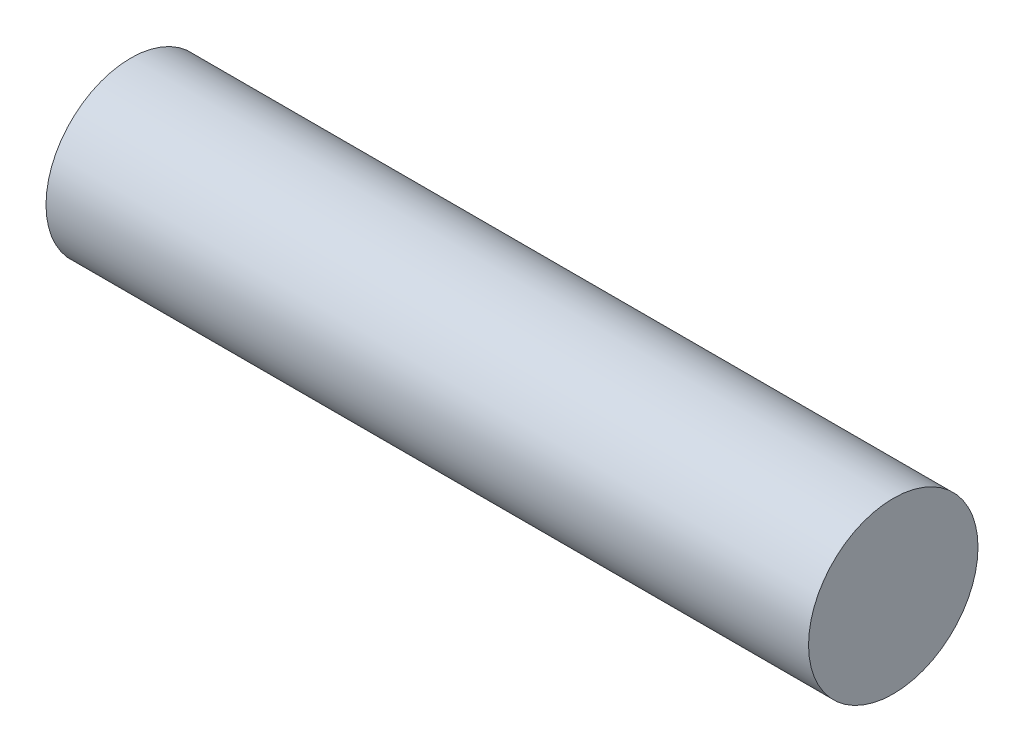
ISO-10303-21;
HEADER;
FILE_DESCRIPTION(('STEP AP214'),'2;1');
FILE_NAME('part.step','',(''),(''),'','','');
FILE_SCHEMA(('AUTOMOTIVE_DESIGN { 1 0 10303 214 1 1 1 1 }'));
ENDSEC;
DATA;
#1=APPLICATION_CONTEXT('core data for automotive mechanical design processes');
#2=APPLICATION_PROTOCOL_DEFINITION('international standard','automotive_design',2000,#1);
#3=PRODUCT_CONTEXT('',#1,'mechanical');
#4=PRODUCT('Part','Part','',(#3));
#5=PRODUCT_RELATED_PRODUCT_CATEGORY('part','',(#4));
#6=PRODUCT_DEFINITION_FORMATION('','',#4);
#7=PRODUCT_DEFINITION_CONTEXT('part definition',#1,'design');
#8=PRODUCT_DEFINITION('design','',#6,#7);
#9=PRODUCT_DEFINITION_SHAPE('','',#8);
#10=(LENGTH_UNIT() NAMED_UNIT(*) SI_UNIT(.MILLI.,.METRE.));
#11=(NAMED_UNIT(*) PLANE_ANGLE_UNIT() SI_UNIT($,.RADIAN.));
#12=(NAMED_UNIT(*) SI_UNIT($,.STERADIAN.) SOLID_ANGLE_UNIT());
#13=UNCERTAINTY_MEASURE_WITH_UNIT(LENGTH_MEASURE(1.E-05),#10,'distance_accuracy_value','');
#14=(GEOMETRIC_REPRESENTATION_CONTEXT(3) GLOBAL_UNCERTAINTY_ASSIGNED_CONTEXT((#13)) GLOBAL_UNIT_ASSIGNED_CONTEXT((#10,
#11,#12)) REPRESENTATION_CONTEXT('',''));
#15=CARTESIAN_POINT('',(0.,0.,0.));
#16=DIRECTION('',(0.,0.,1.));
#17=DIRECTION('',(1.,0.,0.));
#18=AXIS2_PLACEMENT_3D('',#15,#16,#17);
#19=CARTESIAN_POINT('',(9.,0.,0.));
#20=DIRECTION('',(-1.,0.,0.));
#21=DIRECTION('',(0.,0.,1.));
#22=AXIS2_PLACEMENT_3D('',#19,#20,#21);
#23=CYLINDRICAL_SURFACE('',#22,1.);
#24=CARTESIAN_POINT('',(9.,0.,0.));
#25=DIRECTION('',(1.,0.,0.));
#26=DIRECTION('',(0.,0.,-1.));
#27=AXIS2_PLACEMENT_3D('',#24,#25,#26);
#28=CIRCLE('',#27,1.);
#29=CARTESIAN_POINT('',(9.,0.,-1.));
#30=VERTEX_POINT('',#29);
#31=EDGE_CURVE('E10',#30,#30,#28,.T.);
#32=ORIENTED_EDGE('',*,*,#31,.F.);
#33=EDGE_LOOP('',(#32));
#34=FACE_BOUND('',#33,.T.);
#35=CARTESIAN_POINT('',(0.,0.,0.));
#36=DIRECTION('',(1.,0.,0.));
#37=DIRECTION('',(0.,0.,-1.));
#38=AXIS2_PLACEMENT_3D('',#35,#36,#37);
#39=CIRCLE('',#38,1.);
#40=CARTESIAN_POINT('',(0.,0.,-1.));
#41=VERTEX_POINT('',#40);
#42=EDGE_CURVE('E34',#41,#41,#39,.T.);
#43=ORIENTED_EDGE('',*,*,#42,.T.);
#44=EDGE_LOOP('',(#43));
#45=FACE_BOUND('',#44,.T.);
#46=ADVANCED_FACE('F31',(#34,#45),#23,.T.);
#47=CARTESIAN_POINT('',(9.,0.,0.));
#48=DIRECTION('',(1.,0.,0.));
#49=DIRECTION('',(0.,0.,-1.));
#50=AXIS2_PLACEMENT_3D('',#47,#48,#49);
#51=PLANE('',#50);
#52=ORIENTED_EDGE('',*,*,#31,.T.);
#53=EDGE_LOOP('',(#52));
#54=FACE_BOUND('',#53,.T.);
#55=ADVANCED_FACE('F46',(#54),#51,.T.);
#56=CARTESIAN_POINT('',(0.,0.,0.));
#57=DIRECTION('',(1.,0.,0.));
#58=DIRECTION('',(0.,0.,-1.));
#59=AXIS2_PLACEMENT_3D('',#56,#57,#58);
#60=PLANE('',#59);
#61=ORIENTED_EDGE('',*,*,#42,.F.);
#62=EDGE_LOOP('',(#61));
#63=FACE_BOUND('',#62,.T.);
#64=ADVANCED_FACE('F44',(#63),#60,.F.);
#65=CLOSED_SHELL('',(#46,#55,#64));
#66=MANIFOLD_SOLID_BREP('B2',#65);
#67=ADVANCED_BREP_SHAPE_REPRESENTATION('',(#18,#66),#14);
#68=SHAPE_DEFINITION_REPRESENTATION(#9,#67);
ENDSEC;
END-ISO-10303-21;
